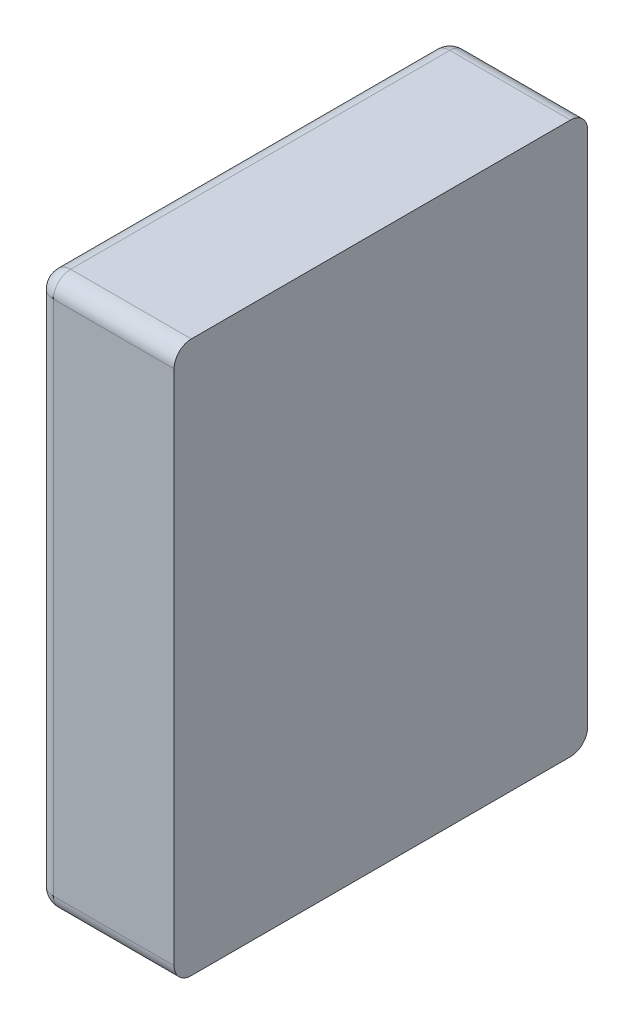
ISO-10303-21;
HEADER;
FILE_DESCRIPTION(('STEP AP214'),'2;1');
FILE_NAME('part.step','',(''),(''),'','','');
FILE_SCHEMA(('AUTOMOTIVE_DESIGN { 1 0 10303 214 1 1 1 1 }'));
ENDSEC;
DATA;
#1=APPLICATION_CONTEXT('core data for automotive mechanical design processes');
#2=APPLICATION_PROTOCOL_DEFINITION('international standard','automotive_design',2000,#1);
#3=PRODUCT_CONTEXT('',#1,'mechanical');
#4=PRODUCT('Part','Part','',(#3));
#5=PRODUCT_RELATED_PRODUCT_CATEGORY('part','',(#4));
#6=PRODUCT_DEFINITION_FORMATION('','',#4);
#7=PRODUCT_DEFINITION_CONTEXT('part definition',#1,'design');
#8=PRODUCT_DEFINITION('design','',#6,#7);
#9=PRODUCT_DEFINITION_SHAPE('','',#8);
#10=(LENGTH_UNIT() NAMED_UNIT(*) SI_UNIT(.MILLI.,.METRE.));
#11=(NAMED_UNIT(*) PLANE_ANGLE_UNIT() SI_UNIT($,.RADIAN.));
#12=(NAMED_UNIT(*) SI_UNIT($,.STERADIAN.) SOLID_ANGLE_UNIT());
#13=UNCERTAINTY_MEASURE_WITH_UNIT(LENGTH_MEASURE(1.E-05),#10,'distance_accuracy_value','');
#14=(GEOMETRIC_REPRESENTATION_CONTEXT(3) GLOBAL_UNCERTAINTY_ASSIGNED_CONTEXT((#13)) GLOBAL_UNIT_ASSIGNED_CONTEXT((#10,
#11,#12)) REPRESENTATION_CONTEXT('',''));
#15=CARTESIAN_POINT('',(0.,0.,0.));
#16=DIRECTION('',(0.,0.,1.));
#17=DIRECTION('',(1.,0.,0.));
#18=AXIS2_PLACEMENT_3D('',#15,#16,#17);
#19=CARTESIAN_POINT('',(-0.7,-0.4,0.));
#20=DIRECTION('',(0.,0.,1.));
#21=DIRECTION('',(1.,0.,0.));
#22=AXIS2_PLACEMENT_3D('',#19,#20,#21);
#23=PLANE('',#22);
#24=DIRECTION('',(0.,1.,0.));
#25=VECTOR('',#24,1.);
#26=CARTESIAN_POINT('',(-0.775,-0.4,0.));
#27=LINE('',#26,#25);
#28=CARTESIAN_POINT('',(-0.775,-0.375,0.));
#29=VERTEX_POINT('',#28);
#30=CARTESIAN_POINT('',(-0.775,0.375,0.));
#31=VERTEX_POINT('',#30);
#32=EDGE_CURVE('E177',#29,#31,#27,.T.);
#33=ORIENTED_EDGE('',*,*,#32,.T.);
#34=DIRECTION('',(1.,0.,0.));
#35=VECTOR('',#34,1.);
#36=CARTESIAN_POINT('',(-0.7,0.375,0.));
#37=LINE('',#36,#35);
#38=CARTESIAN_POINT('',(-0.6,0.375,0.));
#39=VERTEX_POINT('',#38);
#40=EDGE_CURVE('E81',#31,#39,#37,.T.);
#41=ORIENTED_EDGE('',*,*,#40,.T.);
#42=DIRECTION('',(0.,1.,0.));
#43=VECTOR('',#42,1.);
#44=CARTESIAN_POINT('',(-0.6,-0.4,0.));
#45=LINE('',#44,#43);
#46=CARTESIAN_POINT('',(-0.6,-0.375,0.));
#47=VERTEX_POINT('',#46);
#48=EDGE_CURVE('E210',#47,#39,#45,.T.);
#49=ORIENTED_EDGE('',*,*,#48,.F.);
#50=DIRECTION('',(-1.,0.,0.));
#51=VECTOR('',#50,1.);
#52=CARTESIAN_POINT('',(-0.8,-0.375,0.));
#53=LINE('',#52,#51);
#54=EDGE_CURVE('E95',#47,#29,#53,.T.);
#55=ORIENTED_EDGE('',*,*,#54,.T.);
#56=EDGE_LOOP('',(#33,#41,#49,#55));
#57=FACE_BOUND('',#56,.T.);
#58=ADVANCED_FACE('F17',(#57),#23,.F.);
#59=CARTESIAN_POINT('',(-0.4,-0.4,0.3));
#60=DIRECTION('',(0.,-1.,0.));
#61=DIRECTION('',(0.,0.,-1.));
#62=AXIS2_PLACEMENT_3D('',#59,#60,#61);
#63=PLANE('',#62);
#64=DIRECTION('',(0.,0.,1.));
#65=VECTOR('',#64,1.);
#66=CARTESIAN_POINT('',(-0.6,-0.4,0.499600058));
#67=LINE('',#66,#65);
#68=CARTESIAN_POINT('',(-0.6,-0.4,0.025));
#69=VERTEX_POINT('',#68);
#70=CARTESIAN_POINT('',(-0.6,-0.4,0.575));
#71=VERTEX_POINT('',#70);
#72=EDGE_CURVE('E132',#69,#71,#67,.T.);
#73=ORIENTED_EDGE('',*,*,#72,.T.);
#74=DIRECTION('',(-1.,0.,0.));
#75=VECTOR('',#74,1.);
#76=CARTESIAN_POINT('',(-0.8,-0.4,0.575));
#77=LINE('',#76,#75);
#78=CARTESIAN_POINT('',(-0.775,-0.4,0.575));
#79=VERTEX_POINT('',#78);
#80=EDGE_CURVE('E11',#71,#79,#77,.T.);
#81=ORIENTED_EDGE('',*,*,#80,.T.);
#82=DIRECTION('',(0.,0.,-1.));
#83=VECTOR('',#82,1.);
#84=CARTESIAN_POINT('',(-0.775,-0.4,0.));
#85=LINE('',#84,#83);
#86=CARTESIAN_POINT('',(-0.775,-0.4,0.025));
#87=VERTEX_POINT('',#86);
#88=EDGE_CURVE('E28',#79,#87,#85,.T.);
#89=ORIENTED_EDGE('',*,*,#88,.T.);
#90=DIRECTION('',(1.,0.,0.));
#91=VECTOR('',#90,1.);
#92=CARTESIAN_POINT('',(-0.6,-0.4,0.025));
#93=LINE('',#92,#91);
#94=EDGE_CURVE('E260',#87,#69,#93,.T.);
#95=ORIENTED_EDGE('',*,*,#94,.T.);
#96=EDGE_LOOP('',(#73,#81,#89,#95));
#97=FACE_BOUND('',#96,.T.);
#98=ADVANCED_FACE('F312',(#97),#63,.T.);
#99=CARTESIAN_POINT('',(-0.4,0.4,0.3));
#100=DIRECTION('',(0.,-1.,0.));
#101=DIRECTION('',(0.,0.,-1.));
#102=AXIS2_PLACEMENT_3D('',#99,#100,#101);
#103=PLANE('',#102);
#104=DIRECTION('',(0.,0.,1.));
#105=VECTOR('',#104,1.);
#106=CARTESIAN_POINT('',(-0.775,0.4,0.3));
#107=LINE('',#106,#105);
#108=CARTESIAN_POINT('',(-0.775,0.4,0.025));
#109=VERTEX_POINT('',#108);
#110=CARTESIAN_POINT('',(-0.775,0.4,0.575));
#111=VERTEX_POINT('',#110);
#112=EDGE_CURVE('E186',#109,#111,#107,.T.);
#113=ORIENTED_EDGE('',*,*,#112,.T.);
#114=DIRECTION('',(1.,0.,0.));
#115=VECTOR('',#114,1.);
#116=CARTESIAN_POINT('',(-0.4,0.4,0.575));
#117=LINE('',#116,#115);
#118=CARTESIAN_POINT('',(-0.6,0.4,0.575));
#119=VERTEX_POINT('',#118);
#120=EDGE_CURVE('E21',#111,#119,#117,.T.);
#121=ORIENTED_EDGE('',*,*,#120,.T.);
#122=DIRECTION('',(0.,0.,1.));
#123=VECTOR('',#122,1.);
#124=CARTESIAN_POINT('',(-0.6,0.4,0.499600058));
#125=LINE('',#124,#123);
#126=CARTESIAN_POINT('',(-0.6,0.4,0.025));
#127=VERTEX_POINT('',#126);
#128=EDGE_CURVE('E175',#127,#119,#125,.T.);
#129=ORIENTED_EDGE('',*,*,#128,.F.);
#130=DIRECTION('',(-1.,0.,0.));
#131=VECTOR('',#130,1.);
#132=CARTESIAN_POINT('',(-0.4,0.4,0.025));
#133=LINE('',#132,#131);
#134=EDGE_CURVE('E160',#127,#109,#133,.T.);
#135=ORIENTED_EDGE('',*,*,#134,.T.);
#136=EDGE_LOOP('',(#113,#121,#129,#135));
#137=FACE_BOUND('',#136,.T.);
#138=ADVANCED_FACE('F236',(#137),#103,.F.);
#139=CARTESIAN_POINT('',(-0.4,-0.375,0.575));
#140=DIRECTION('',(-1.,0.,0.));
#141=DIRECTION('',(0.,0.,-1.));
#142=AXIS2_PLACEMENT_3D('',#139,#140,#141);
#143=CYLINDRICAL_SURFACE('',#142,0.025);
#144=CARTESIAN_POINT('',(-0.6,-0.375,0.575));
#145=DIRECTION('',(1.,0.,0.));
#146=DIRECTION('',(0.,0.,1.));
#147=AXIS2_PLACEMENT_3D('',#144,#145,#146);
#148=CIRCLE('',#147,0.025);
#149=CARTESIAN_POINT('',(-0.6,-0.375,0.6));
#150=VERTEX_POINT('',#149);
#151=EDGE_CURVE('E122',#150,#71,#148,.T.);
#152=ORIENTED_EDGE('',*,*,#151,.F.);
#153=DIRECTION('',(1.,0.,0.));
#154=VECTOR('',#153,1.);
#155=CARTESIAN_POINT('',(-0.6,-0.375,0.6));
#156=LINE('',#155,#154);
#157=CARTESIAN_POINT('',(-0.775,-0.375,0.6));
#158=VERTEX_POINT('',#157);
#159=EDGE_CURVE('E126',#158,#150,#156,.T.);
#160=ORIENTED_EDGE('',*,*,#159,.F.);
#161=CARTESIAN_POINT('',(-0.775,-0.375,0.575));
#162=DIRECTION('',(-1.,0.,0.));
#163=DIRECTION('',(0.,0.,1.));
#164=AXIS2_PLACEMENT_3D('',#161,#162,#163);
#165=CIRCLE('',#164,0.025);
#166=EDGE_CURVE('E262',#79,#158,#165,.T.);
#167=ORIENTED_EDGE('',*,*,#166,.F.);
#168=ORIENTED_EDGE('',*,*,#80,.F.);
#169=EDGE_LOOP('',(#152,#160,#167,#168));
#170=FACE_BOUND('',#169,.T.);
#171=ADVANCED_FACE('F124',(#170),#143,.T.);
#172=CARTESIAN_POINT('',(-0.775,-0.375,0.3));
#173=DIRECTION('',(0.,0.,-1.));
#174=DIRECTION('',(1.,0.,0.));
#175=AXIS2_PLACEMENT_3D('',#172,#173,#174);
#176=CYLINDRICAL_SURFACE('',#175,0.025);
#177=CARTESIAN_POINT('',(-0.775,-0.375,0.025));
#178=DIRECTION('',(0.,0.,-1.));
#179=DIRECTION('',(-1.,0.,0.));
#180=AXIS2_PLACEMENT_3D('',#177,#178,#179);
#181=CIRCLE('',#180,0.025);
#182=CARTESIAN_POINT('',(-0.8,-0.375,0.025));
#183=VERTEX_POINT('',#182);
#184=EDGE_CURVE('E196',#87,#183,#181,.T.);
#185=ORIENTED_EDGE('',*,*,#184,.F.);
#186=ORIENTED_EDGE('',*,*,#88,.F.);
#187=CARTESIAN_POINT('',(-0.775,-0.375,0.575));
#188=DIRECTION('',(0.,0.,1.));
#189=DIRECTION('',(1.,0.,0.));
#190=AXIS2_PLACEMENT_3D('',#187,#188,#189);
#191=CIRCLE('',#190,0.025);
#192=CARTESIAN_POINT('',(-0.8,-0.375,0.575));
#193=VERTEX_POINT('',#192);
#194=EDGE_CURVE('E264',#193,#79,#191,.T.);
#195=ORIENTED_EDGE('',*,*,#194,.F.);
#196=DIRECTION('',(0.,0.,1.));
#197=VECTOR('',#196,1.);
#198=CARTESIAN_POINT('',(-0.8,-0.375,0.6));
#199=LINE('',#198,#197);
#200=EDGE_CURVE('E171',#183,#193,#199,.T.);
#201=ORIENTED_EDGE('',*,*,#200,.F.);
#202=EDGE_LOOP('',(#185,#186,#195,#201));
#203=FACE_BOUND('',#202,.T.);
#204=ADVANCED_FACE('F19',(#203),#176,.T.);
#205=CARTESIAN_POINT('',(-0.4,-0.375,0.025));
#206=DIRECTION('',(1.,0.,0.));
#207=DIRECTION('',(0.,0.,1.));
#208=AXIS2_PLACEMENT_3D('',#205,#206,#207);
#209=CYLINDRICAL_SURFACE('',#208,0.025);
#210=CARTESIAN_POINT('',(-0.6,-0.375,0.025));
#211=DIRECTION('',(1.,0.,0.));
#212=DIRECTION('',(0.,0.,1.));
#213=AXIS2_PLACEMENT_3D('',#210,#211,#212);
#214=CIRCLE('',#213,0.025);
#215=EDGE_CURVE('E170',#69,#47,#214,.T.);
#216=ORIENTED_EDGE('',*,*,#215,.F.);
#217=ORIENTED_EDGE('',*,*,#94,.F.);
#218=CARTESIAN_POINT('',(-0.775,-0.375,0.025));
#219=DIRECTION('',(-1.,0.,0.));
#220=DIRECTION('',(0.,0.,1.));
#221=AXIS2_PLACEMENT_3D('',#218,#219,#220);
#222=CIRCLE('',#221,0.025);
#223=EDGE_CURVE('E192',#29,#87,#222,.T.);
#224=ORIENTED_EDGE('',*,*,#223,.F.);
#225=ORIENTED_EDGE('',*,*,#54,.F.);
#226=EDGE_LOOP('',(#216,#217,#224,#225));
#227=FACE_BOUND('',#226,.T.);
#228=ADVANCED_FACE('F448',(#227),#209,.T.);
#229=CARTESIAN_POINT('',(-0.775,-0.375,0.575));
#230=DIRECTION('',(0.,0.,1.));
#231=DIRECTION('',(1.,0.,0.));
#232=AXIS2_PLACEMENT_3D('',#229,#230,#231);
#233=SPHERICAL_SURFACE('',#232,0.025);
#234=ORIENTED_EDGE('',*,*,#194,.T.);
#235=ORIENTED_EDGE('',*,*,#166,.T.);
#236=CARTESIAN_POINT('',(-0.775,-0.375,0.575));
#237=DIRECTION('',(0.,1.,0.));
#238=DIRECTION('',(0.,0.,-1.));
#239=AXIS2_PLACEMENT_3D('',#236,#237,#238);
#240=CIRCLE('',#239,0.025);
#241=EDGE_CURVE('E180',#193,#158,#240,.T.);
#242=ORIENTED_EDGE('',*,*,#241,.F.);
#243=EDGE_LOOP('',(#234,#235,#242));
#244=FACE_BOUND('',#243,.T.);
#245=ADVANCED_FACE('F292',(#244),#233,.T.);
#246=CARTESIAN_POINT('',(-0.775,-0.375,0.025));
#247=DIRECTION('',(0.,0.,1.));
#248=DIRECTION('',(1.,0.,0.));
#249=AXIS2_PLACEMENT_3D('',#246,#247,#248);
#250=SPHERICAL_SURFACE('',#249,0.025);
#251=ORIENTED_EDGE('',*,*,#223,.T.);
#252=ORIENTED_EDGE('',*,*,#184,.T.);
#253=CARTESIAN_POINT('',(-0.775,-0.375,0.025));
#254=DIRECTION('',(0.,1.,0.));
#255=DIRECTION('',(0.,0.,-1.));
#256=AXIS2_PLACEMENT_3D('',#253,#254,#255);
#257=CIRCLE('',#256,0.025);
#258=EDGE_CURVE('E163',#29,#183,#257,.T.);
#259=ORIENTED_EDGE('',*,*,#258,.F.);
#260=EDGE_LOOP('',(#251,#252,#259));
#261=FACE_BOUND('',#260,.T.);
#262=ADVANCED_FACE('F331',(#261),#250,.T.);
#263=CARTESIAN_POINT('',(-0.7,0.375,0.575));
#264=DIRECTION('',(1.,0.,0.));
#265=DIRECTION('',(0.,0.,1.));
#266=AXIS2_PLACEMENT_3D('',#263,#264,#265);
#267=CYLINDRICAL_SURFACE('',#266,0.025);
#268=CARTESIAN_POINT('',(-0.6,0.375,0.575));
#269=DIRECTION('',(1.,0.,0.));
#270=DIRECTION('',(0.,0.,1.));
#271=AXIS2_PLACEMENT_3D('',#268,#269,#270);
#272=CIRCLE('',#271,0.025);
#273=CARTESIAN_POINT('',(-0.6,0.375,0.6));
#274=VERTEX_POINT('',#273);
#275=EDGE_CURVE('E133',#119,#274,#272,.T.);
#276=ORIENTED_EDGE('',*,*,#275,.F.);
#277=ORIENTED_EDGE('',*,*,#120,.F.);
#278=CARTESIAN_POINT('',(-0.775,0.375,0.575));
#279=DIRECTION('',(-1.,0.,0.));
#280=DIRECTION('',(0.,0.,1.));
#281=AXIS2_PLACEMENT_3D('',#278,#279,#280);
#282=CIRCLE('',#281,0.025);
#283=CARTESIAN_POINT('',(-0.775,0.375,0.6));
#284=VERTEX_POINT('',#283);
#285=EDGE_CURVE('E249',#284,#111,#282,.T.);
#286=ORIENTED_EDGE('',*,*,#285,.F.);
#287=DIRECTION('',(-1.,0.,0.));
#288=VECTOR('',#287,1.);
#289=CARTESIAN_POINT('',(-0.7,0.375,0.6));
#290=LINE('',#289,#288);
#291=EDGE_CURVE('E150',#274,#284,#290,.T.);
#292=ORIENTED_EDGE('',*,*,#291,.F.);
#293=EDGE_LOOP('',(#276,#277,#286,#292));
#294=FACE_BOUND('',#293,.T.);
#295=ADVANCED_FACE('F295',(#294),#267,.T.);
#296=CARTESIAN_POINT('',(-0.775,-0.4,0.575));
#297=DIRECTION('',(0.,-1.,0.));
#298=DIRECTION('',(0.,0.,1.));
#299=AXIS2_PLACEMENT_3D('',#296,#297,#298);
#300=CYLINDRICAL_SURFACE('',#299,0.025);
#301=ORIENTED_EDGE('',*,*,#241,.T.);
#302=DIRECTION('',(0.,-1.,0.));
#303=VECTOR('',#302,1.);
#304=CARTESIAN_POINT('',(-0.775,-0.4,0.6));
#305=LINE('',#304,#303);
#306=EDGE_CURVE('E141',#284,#158,#305,.T.);
#307=ORIENTED_EDGE('',*,*,#306,.F.);
#308=CARTESIAN_POINT('',(-0.775,0.375,0.575));
#309=DIRECTION('',(0.,1.,0.));
#310=DIRECTION('',(0.,0.,1.));
#311=AXIS2_PLACEMENT_3D('',#308,#309,#310);
#312=CIRCLE('',#311,0.025);
#313=CARTESIAN_POINT('',(-0.8,0.375,0.575));
#314=VERTEX_POINT('',#313);
#315=EDGE_CURVE('E247',#314,#284,#312,.T.);
#316=ORIENTED_EDGE('',*,*,#315,.F.);
#317=DIRECTION('',(0.,1.,0.));
#318=VECTOR('',#317,1.);
#319=CARTESIAN_POINT('',(-0.8,-0.4,0.575));
#320=LINE('',#319,#318);
#321=EDGE_CURVE('E143',#193,#314,#320,.T.);
#322=ORIENTED_EDGE('',*,*,#321,.F.);
#323=EDGE_LOOP('',(#301,#307,#316,#322));
#324=FACE_BOUND('',#323,.T.);
#325=ADVANCED_FACE('F294',(#324),#300,.T.);
#326=CARTESIAN_POINT('',(-0.775,-0.4,0.025));
#327=DIRECTION('',(0.,-1.,0.));
#328=DIRECTION('',(0.,0.,1.));
#329=AXIS2_PLACEMENT_3D('',#326,#327,#328);
#330=CYLINDRICAL_SURFACE('',#329,0.025);
#331=ORIENTED_EDGE('',*,*,#258,.T.);
#332=DIRECTION('',(0.,-1.,0.));
#333=VECTOR('',#332,1.);
#334=CARTESIAN_POINT('',(-0.8,-0.4,0.025));
#335=LINE('',#334,#333);
#336=CARTESIAN_POINT('',(-0.8,0.375,0.025));
#337=VERTEX_POINT('',#336);
#338=EDGE_CURVE('E176',#337,#183,#335,.T.);
#339=ORIENTED_EDGE('',*,*,#338,.F.);
#340=CARTESIAN_POINT('',(-0.775,0.375,0.025));
#341=DIRECTION('',(0.,1.,0.));
#342=DIRECTION('',(0.,0.,1.));
#343=AXIS2_PLACEMENT_3D('',#340,#341,#342);
#344=CIRCLE('',#343,0.025);
#345=EDGE_CURVE('E200',#31,#337,#344,.T.);
#346=ORIENTED_EDGE('',*,*,#345,.F.);
#347=ORIENTED_EDGE('',*,*,#32,.F.);
#348=EDGE_LOOP('',(#331,#339,#346,#347));
#349=FACE_BOUND('',#348,.T.);
#350=ADVANCED_FACE('F289',(#349),#330,.T.);
#351=CARTESIAN_POINT('',(-0.7,0.375,0.025));
#352=DIRECTION('',(-1.,0.,0.));
#353=DIRECTION('',(0.,0.,-1.));
#354=AXIS2_PLACEMENT_3D('',#351,#352,#353);
#355=CYLINDRICAL_SURFACE('',#354,0.025);
#356=CARTESIAN_POINT('',(-0.6,0.375,0.025));
#357=DIRECTION('',(1.,0.,0.));
#358=DIRECTION('',(0.,0.,1.));
#359=AXIS2_PLACEMENT_3D('',#356,#357,#358);
#360=CIRCLE('',#359,0.025);
#361=EDGE_CURVE('E215',#39,#127,#360,.T.);
#362=ORIENTED_EDGE('',*,*,#361,.F.);
#363=ORIENTED_EDGE('',*,*,#40,.F.);
#364=CARTESIAN_POINT('',(-0.775,0.375,0.025));
#365=DIRECTION('',(-1.,0.,0.));
#366=DIRECTION('',(0.,0.,1.));
#367=AXIS2_PLACEMENT_3D('',#364,#365,#366);
#368=CIRCLE('',#367,0.025);
#369=EDGE_CURVE('E185',#109,#31,#368,.T.);
#370=ORIENTED_EDGE('',*,*,#369,.F.);
#371=ORIENTED_EDGE('',*,*,#134,.F.);
#372=EDGE_LOOP('',(#362,#363,#370,#371));
#373=FACE_BOUND('',#372,.T.);
#374=ADVANCED_FACE('F297',(#373),#355,.T.);
#375=CARTESIAN_POINT('',(-0.775,0.375,0.575));
#376=DIRECTION('',(0.,0.,1.));
#377=DIRECTION('',(1.,0.,0.));
#378=AXIS2_PLACEMENT_3D('',#375,#376,#377);
#379=SPHERICAL_SURFACE('',#378,0.025);
#380=ORIENTED_EDGE('',*,*,#315,.T.);
#381=ORIENTED_EDGE('',*,*,#285,.T.);
#382=CARTESIAN_POINT('',(-0.775,0.375,0.575));
#383=DIRECTION('',(0.,0.,-1.));
#384=DIRECTION('',(1.,0.,0.));
#385=AXIS2_PLACEMENT_3D('',#382,#383,#384);
#386=CIRCLE('',#385,0.025);
#387=EDGE_CURVE('E221',#314,#111,#386,.T.);
#388=ORIENTED_EDGE('',*,*,#387,.F.);
#389=EDGE_LOOP('',(#380,#381,#388));
#390=FACE_BOUND('',#389,.T.);
#391=ADVANCED_FACE('F246',(#390),#379,.T.);
#392=CARTESIAN_POINT('',(-0.775,0.375,0.025));
#393=DIRECTION('',(0.,0.,1.));
#394=DIRECTION('',(1.,0.,0.));
#395=AXIS2_PLACEMENT_3D('',#392,#393,#394);
#396=SPHERICAL_SURFACE('',#395,0.025);
#397=ORIENTED_EDGE('',*,*,#369,.T.);
#398=ORIENTED_EDGE('',*,*,#345,.T.);
#399=CARTESIAN_POINT('',(-0.775,0.375,0.025));
#400=DIRECTION('',(0.,0.,1.));
#401=DIRECTION('',(-1.,0.,0.));
#402=AXIS2_PLACEMENT_3D('',#399,#400,#401);
#403=CIRCLE('',#402,0.025);
#404=EDGE_CURVE('E181',#109,#337,#403,.T.);
#405=ORIENTED_EDGE('',*,*,#404,.F.);
#406=EDGE_LOOP('',(#397,#398,#405));
#407=FACE_BOUND('',#406,.T.);
#408=ADVANCED_FACE('F300',(#407),#396,.T.);
#409=CARTESIAN_POINT('',(-0.775,0.375,0.3));
#410=DIRECTION('',(0.,0.,1.));
#411=DIRECTION('',(-1.,0.,0.));
#412=AXIS2_PLACEMENT_3D('',#409,#410,#411);
#413=CYLINDRICAL_SURFACE('',#412,0.025);
#414=ORIENTED_EDGE('',*,*,#387,.T.);
#415=ORIENTED_EDGE('',*,*,#112,.F.);
#416=ORIENTED_EDGE('',*,*,#404,.T.);
#417=DIRECTION('',(0.,0.,-1.));
#418=VECTOR('',#417,1.);
#419=CARTESIAN_POINT('',(-0.8,0.375,0.3));
#420=LINE('',#419,#418);
#421=EDGE_CURVE('E166',#314,#337,#420,.T.);
#422=ORIENTED_EDGE('',*,*,#421,.F.);
#423=EDGE_LOOP('',(#414,#415,#416,#422));
#424=FACE_BOUND('',#423,.T.);
#425=ADVANCED_FACE('F242',(#424),#413,.T.);
#426=CARTESIAN_POINT('',(-0.6,-0.4,0.499600058));
#427=DIRECTION('',(-1.,0.,0.));
#428=DIRECTION('',(0.,0.,1.));
#429=AXIS2_PLACEMENT_3D('',#426,#427,#428);
#430=PLANE('',#429);
#431=ORIENTED_EDGE('',*,*,#128,.T.);
#432=ORIENTED_EDGE('',*,*,#275,.T.);
#433=DIRECTION('',(0.,1.,0.));
#434=VECTOR('',#433,1.);
#435=CARTESIAN_POINT('',(-0.6,-0.4,0.6));
#436=LINE('',#435,#434);
#437=EDGE_CURVE('E139',#150,#274,#436,.T.);
#438=ORIENTED_EDGE('',*,*,#437,.F.);
#439=ORIENTED_EDGE('',*,*,#151,.T.);
#440=ORIENTED_EDGE('',*,*,#72,.F.);
#441=ORIENTED_EDGE('',*,*,#215,.T.);
#442=ORIENTED_EDGE('',*,*,#48,.T.);
#443=ORIENTED_EDGE('',*,*,#361,.T.);
#444=EDGE_LOOP('',(#431,#432,#438,#439,#440,#441,#442,#443));
#445=FACE_BOUND('',#444,.T.);
#446=ADVANCED_FACE('F146',(#445),#430,.F.);
#447=CARTESIAN_POINT('',(-0.8,-0.4,0.3));
#448=DIRECTION('',(1.,0.,0.));
#449=DIRECTION('',(0.,1.,0.));
#450=AXIS2_PLACEMENT_3D('',#447,#448,#449);
#451=PLANE('',#450);
#452=ORIENTED_EDGE('',*,*,#321,.T.);
#453=ORIENTED_EDGE('',*,*,#421,.T.);
#454=ORIENTED_EDGE('',*,*,#338,.T.);
#455=ORIENTED_EDGE('',*,*,#200,.T.);
#456=EDGE_LOOP('',(#452,#453,#454,#455));
#457=FACE_BOUND('',#456,.T.);
#458=ADVANCED_FACE('F284',(#457),#451,.F.);
#459=CARTESIAN_POINT('',(-0.7,-0.4,0.6));
#460=DIRECTION('',(0.,0.,-1.));
#461=DIRECTION('',(0.,-1.,0.));
#462=AXIS2_PLACEMENT_3D('',#459,#460,#461);
#463=PLANE('',#462);
#464=ORIENTED_EDGE('',*,*,#437,.T.);
#465=ORIENTED_EDGE('',*,*,#291,.T.);
#466=ORIENTED_EDGE('',*,*,#306,.T.);
#467=ORIENTED_EDGE('',*,*,#159,.T.);
#468=EDGE_LOOP('',(#464,#465,#466,#467));
#469=FACE_BOUND('',#468,.T.);
#470=ADVANCED_FACE('F137',(#469),#463,.F.);
#471=CLOSED_SHELL('',(#58,#98,#138,#171,#204,#228,#245,#262,#295,#325,#350,#374,#391,#408,#425,
#446,#458,#470));
#472=MANIFOLD_SOLID_BREP('B1',#471);
#473=ADVANCED_BREP_SHAPE_REPRESENTATION('',(#18,#472),#14);
#474=SHAPE_DEFINITION_REPRESENTATION(#9,#473);
ENDSEC;
END-ISO-10303-21;
